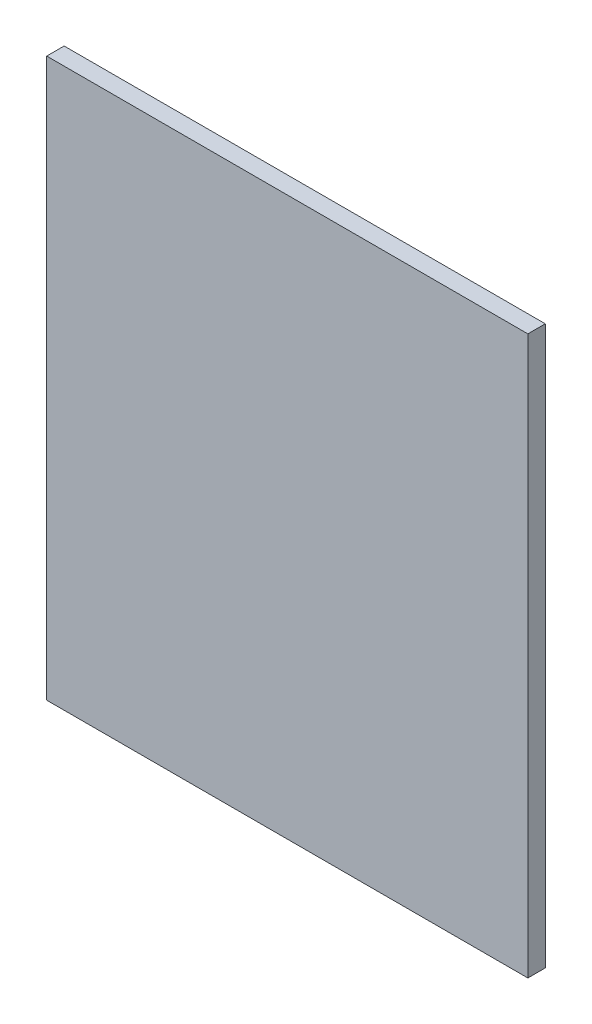
ISO-10303-21;
HEADER;
FILE_DESCRIPTION(('STEP AP214'),'2;1');
FILE_NAME('part.step','',(''),(''),'','','');
FILE_SCHEMA(('AUTOMOTIVE_DESIGN { 1 0 10303 214 1 1 1 1 }'));
ENDSEC;
DATA;
#1=APPLICATION_CONTEXT('core data for automotive mechanical design processes');
#2=APPLICATION_PROTOCOL_DEFINITION('international standard','automotive_design',2000,#1);
#3=PRODUCT_CONTEXT('',#1,'mechanical');
#4=PRODUCT('Part','Part','',(#3));
#5=PRODUCT_RELATED_PRODUCT_CATEGORY('part','',(#4));
#6=PRODUCT_DEFINITION_FORMATION('','',#4);
#7=PRODUCT_DEFINITION_CONTEXT('part definition',#1,'design');
#8=PRODUCT_DEFINITION('design','',#6,#7);
#9=PRODUCT_DEFINITION_SHAPE('','',#8);
#10=(LENGTH_UNIT() NAMED_UNIT(*) SI_UNIT(.MILLI.,.METRE.));
#11=(NAMED_UNIT(*) PLANE_ANGLE_UNIT() SI_UNIT($,.RADIAN.));
#12=(NAMED_UNIT(*) SI_UNIT($,.STERADIAN.) SOLID_ANGLE_UNIT());
#13=UNCERTAINTY_MEASURE_WITH_UNIT(LENGTH_MEASURE(1.E-05),#10,'distance_accuracy_value','');
#14=(GEOMETRIC_REPRESENTATION_CONTEXT(3) GLOBAL_UNCERTAINTY_ASSIGNED_CONTEXT((#13)) GLOBAL_UNIT_ASSIGNED_CONTEXT((#10,
#11,#12)) REPRESENTATION_CONTEXT('',''));
#15=CARTESIAN_POINT('',(0.,0.,0.));
#16=DIRECTION('',(0.,0.,1.));
#17=DIRECTION('',(1.,0.,0.));
#18=AXIS2_PLACEMENT_3D('',#15,#16,#17);
#19=CARTESIAN_POINT('',(-43.815,50.8,3.175));
#20=DIRECTION('',(1.,0.,0.));
#21=DIRECTION('',(0.,1.,0.));
#22=AXIS2_PLACEMENT_3D('',#19,#20,#21);
#23=PLANE('',#22);
#24=DIRECTION('',(0.,-1.,0.));
#25=VECTOR('',#24,1.);
#26=CARTESIAN_POINT('',(-43.815,50.8,0.));
#27=LINE('',#26,#25);
#28=CARTESIAN_POINT('',(-43.815,50.8,0.));
#29=VERTEX_POINT('',#28);
#30=CARTESIAN_POINT('',(-43.815,-50.8,0.));
#31=VERTEX_POINT('',#30);
#32=EDGE_CURVE('E101',#29,#31,#27,.T.);
#33=ORIENTED_EDGE('',*,*,#32,.T.);
#34=DIRECTION('',(0.,0.,-1.));
#35=VECTOR('',#34,1.);
#36=CARTESIAN_POINT('',(-43.815,-50.8,3.175));
#37=LINE('',#36,#35);
#38=CARTESIAN_POINT('',(-43.815,-50.8,3.175));
#39=VERTEX_POINT('',#38);
#40=EDGE_CURVE('E11',#39,#31,#37,.T.);
#41=ORIENTED_EDGE('',*,*,#40,.F.);
#42=DIRECTION('',(0.,-1.,0.));
#43=VECTOR('',#42,1.);
#44=CARTESIAN_POINT('',(-43.815,50.8,3.175));
#45=LINE('',#44,#43);
#46=CARTESIAN_POINT('',(-43.815,50.8,3.175));
#47=VERTEX_POINT('',#46);
#48=EDGE_CURVE('E89',#47,#39,#45,.T.);
#49=ORIENTED_EDGE('',*,*,#48,.F.);
#50=DIRECTION('',(0.,0.,-1.));
#51=VECTOR('',#50,1.);
#52=CARTESIAN_POINT('',(-43.815,50.8,3.175));
#53=LINE('',#52,#51);
#54=EDGE_CURVE('E97',#47,#29,#53,.T.);
#55=ORIENTED_EDGE('',*,*,#54,.T.);
#56=EDGE_LOOP('',(#33,#41,#49,#55));
#57=FACE_BOUND('',#56,.T.);
#58=ADVANCED_FACE('F38',(#57),#23,.F.);
#59=CARTESIAN_POINT('',(-43.815,-50.8,3.175));
#60=DIRECTION('',(0.,1.,0.));
#61=DIRECTION('',(0.,0.,1.));
#62=AXIS2_PLACEMENT_3D('',#59,#60,#61);
#63=PLANE('',#62);
#64=DIRECTION('',(1.,0.,0.));
#65=VECTOR('',#64,1.);
#66=CARTESIAN_POINT('',(-43.815,-50.8,0.));
#67=LINE('',#66,#65);
#68=CARTESIAN_POINT('',(43.815,-50.8,0.));
#69=VERTEX_POINT('',#68);
#70=EDGE_CURVE('E93',#31,#69,#67,.T.);
#71=ORIENTED_EDGE('',*,*,#70,.T.);
#72=DIRECTION('',(0.,0.,-1.));
#73=VECTOR('',#72,1.);
#74=CARTESIAN_POINT('',(43.815,-50.8,3.175));
#75=LINE('',#74,#73);
#76=CARTESIAN_POINT('',(43.815,-50.8,3.175));
#77=VERTEX_POINT('',#76);
#78=EDGE_CURVE('E46',#77,#69,#75,.T.);
#79=ORIENTED_EDGE('',*,*,#78,.F.);
#80=DIRECTION('',(1.,0.,0.));
#81=VECTOR('',#80,1.);
#82=CARTESIAN_POINT('',(-43.815,-50.8,3.175));
#83=LINE('',#82,#81);
#84=EDGE_CURVE('E84',#39,#77,#83,.T.);
#85=ORIENTED_EDGE('',*,*,#84,.F.);
#86=ORIENTED_EDGE('',*,*,#40,.T.);
#87=EDGE_LOOP('',(#71,#79,#85,#86));
#88=FACE_BOUND('',#87,.T.);
#89=ADVANCED_FACE('F92',(#88),#63,.F.);
#90=CARTESIAN_POINT('',(43.815,50.8,3.175));
#91=DIRECTION('',(-1.,0.,0.));
#92=DIRECTION('',(0.,-1.,0.));
#93=AXIS2_PLACEMENT_3D('',#90,#91,#92);
#94=PLANE('',#93);
#95=DIRECTION('',(0.,1.,0.));
#96=VECTOR('',#95,1.);
#97=CARTESIAN_POINT('',(43.815,50.8,0.));
#98=LINE('',#97,#96);
#99=CARTESIAN_POINT('',(43.815,50.8,0.));
#100=VERTEX_POINT('',#99);
#101=EDGE_CURVE('E71',#69,#100,#98,.T.);
#102=ORIENTED_EDGE('',*,*,#101,.T.);
#103=DIRECTION('',(0.,0.,-1.));
#104=VECTOR('',#103,1.);
#105=CARTESIAN_POINT('',(43.815,50.8,3.175));
#106=LINE('',#105,#104);
#107=CARTESIAN_POINT('',(43.815,50.8,3.175));
#108=VERTEX_POINT('',#107);
#109=EDGE_CURVE('E94',#108,#100,#106,.T.);
#110=ORIENTED_EDGE('',*,*,#109,.F.);
#111=DIRECTION('',(0.,1.,0.));
#112=VECTOR('',#111,1.);
#113=CARTESIAN_POINT('',(43.815,50.8,3.175));
#114=LINE('',#113,#112);
#115=EDGE_CURVE('E87',#77,#108,#114,.T.);
#116=ORIENTED_EDGE('',*,*,#115,.F.);
#117=ORIENTED_EDGE('',*,*,#78,.T.);
#118=EDGE_LOOP('',(#102,#110,#116,#117));
#119=FACE_BOUND('',#118,.T.);
#120=ADVANCED_FACE('F95',(#119),#94,.F.);
#121=CARTESIAN_POINT('',(-43.815,50.8,3.175));
#122=DIRECTION('',(0.,-1.,0.));
#123=DIRECTION('',(0.,0.,-1.));
#124=AXIS2_PLACEMENT_3D('',#121,#122,#123);
#125=PLANE('',#124);
#126=DIRECTION('',(-1.,0.,0.));
#127=VECTOR('',#126,1.);
#128=CARTESIAN_POINT('',(-43.815,50.8,0.));
#129=LINE('',#128,#127);
#130=EDGE_CURVE('E77',#100,#29,#129,.T.);
#131=ORIENTED_EDGE('',*,*,#130,.T.);
#132=ORIENTED_EDGE('',*,*,#54,.F.);
#133=DIRECTION('',(-1.,0.,0.));
#134=VECTOR('',#133,1.);
#135=CARTESIAN_POINT('',(-43.815,50.8,3.175));
#136=LINE('',#135,#134);
#137=EDGE_CURVE('E54',#108,#47,#136,.T.);
#138=ORIENTED_EDGE('',*,*,#137,.F.);
#139=ORIENTED_EDGE('',*,*,#109,.T.);
#140=EDGE_LOOP('',(#131,#132,#138,#139));
#141=FACE_BOUND('',#140,.T.);
#142=ADVANCED_FACE('F108',(#141),#125,.F.);
#143=CARTESIAN_POINT('',(0.,0.,3.175));
#144=DIRECTION('',(0.,0.,1.));
#145=DIRECTION('',(1.,0.,0.));
#146=AXIS2_PLACEMENT_3D('',#143,#144,#145);
#147=PLANE('',#146);
#148=ORIENTED_EDGE('',*,*,#48,.T.);
#149=ORIENTED_EDGE('',*,*,#84,.T.);
#150=ORIENTED_EDGE('',*,*,#115,.T.);
#151=ORIENTED_EDGE('',*,*,#137,.T.);
#152=EDGE_LOOP('',(#148,#149,#150,#151));
#153=FACE_BOUND('',#152,.T.);
#154=ADVANCED_FACE('F85',(#153),#147,.T.);
#155=CARTESIAN_POINT('',(0.,0.,0.));
#156=DIRECTION('',(0.,0.,1.));
#157=DIRECTION('',(1.,0.,0.));
#158=AXIS2_PLACEMENT_3D('',#155,#156,#157);
#159=PLANE('',#158);
#160=ORIENTED_EDGE('',*,*,#32,.F.);
#161=ORIENTED_EDGE('',*,*,#130,.F.);
#162=ORIENTED_EDGE('',*,*,#101,.F.);
#163=ORIENTED_EDGE('',*,*,#70,.F.);
#164=EDGE_LOOP('',(#160,#161,#162,#163));
#165=FACE_BOUND('',#164,.T.);
#166=ADVANCED_FACE('F111',(#165),#159,.F.);
#167=CLOSED_SHELL('',(#58,#89,#120,#142,#154,#166));
#168=MANIFOLD_SOLID_BREP('B2',#167);
#169=ADVANCED_BREP_SHAPE_REPRESENTATION('',(#18,#168),#14);
#170=SHAPE_DEFINITION_REPRESENTATION(#9,#169);
ENDSEC;
END-ISO-10303-21;
